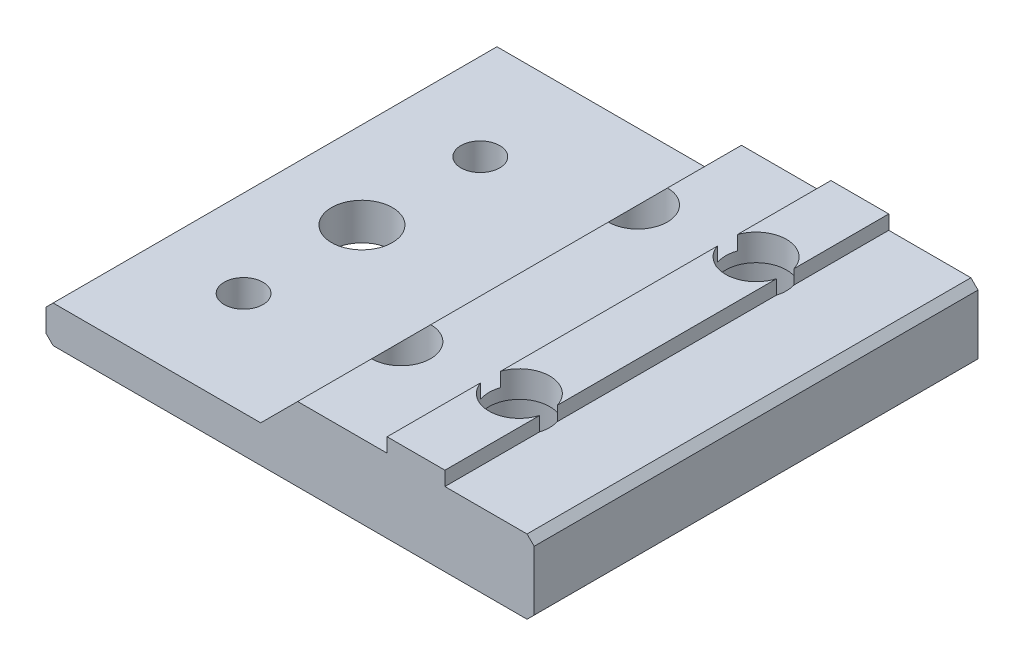
ISO-10303-21;
HEADER;
FILE_DESCRIPTION(('STEP AP214'),'2;1');
FILE_NAME('part.step','',(''),(''),'','','');
FILE_SCHEMA(('AUTOMOTIVE_DESIGN { 1 0 10303 214 1 1 1 1 }'));
ENDSEC;
DATA;
#1=APPLICATION_CONTEXT('core data for automotive mechanical design processes');
#2=APPLICATION_PROTOCOL_DEFINITION('international standard','automotive_design',2000,#1);
#3=PRODUCT_CONTEXT('',#1,'mechanical');
#4=PRODUCT('Part','Part','',(#3));
#5=PRODUCT_RELATED_PRODUCT_CATEGORY('part','',(#4));
#6=PRODUCT_DEFINITION_FORMATION('','',#4);
#7=PRODUCT_DEFINITION_CONTEXT('part definition',#1,'design');
#8=PRODUCT_DEFINITION('design','',#6,#7);
#9=PRODUCT_DEFINITION_SHAPE('','',#8);
#10=(LENGTH_UNIT() NAMED_UNIT(*) SI_UNIT(.MILLI.,.METRE.));
#11=(NAMED_UNIT(*) PLANE_ANGLE_UNIT() SI_UNIT($,.RADIAN.));
#12=(NAMED_UNIT(*) SI_UNIT($,.STERADIAN.) SOLID_ANGLE_UNIT());
#13=UNCERTAINTY_MEASURE_WITH_UNIT(LENGTH_MEASURE(1.E-05),#10,'distance_accuracy_value','');
#14=(GEOMETRIC_REPRESENTATION_CONTEXT(3) GLOBAL_UNCERTAINTY_ASSIGNED_CONTEXT((#13)) GLOBAL_UNIT_ASSIGNED_CONTEXT((#10,
#11,#12)) REPRESENTATION_CONTEXT('',''));
#15=CARTESIAN_POINT('',(0.,0.,0.));
#16=DIRECTION('',(0.,0.,1.));
#17=DIRECTION('',(1.,0.,0.));
#18=AXIS2_PLACEMENT_3D('',#15,#16,#17);
#19=CARTESIAN_POINT('',(58.6051391759039,56.6525658287971,11.1125));
#20=DIRECTION('',(0.,-1.,0.));
#21=DIRECTION('',(1.,0.,0.));
#22=AXIS2_PLACEMENT_3D('',#19,#20,#21);
#23=CYLINDRICAL_SURFACE('',#22,3.2639);
#24=CARTESIAN_POINT('',(58.6051391759039,16.9531190156371,11.1125));
#25=DIRECTION('',(0.,-1.,0.));
#26=DIRECTION('',(1.,0.,0.));
#27=AXIS2_PLACEMENT_3D('',#24,#25,#26);
#28=CIRCLE('',#27,3.2639);
#29=CARTESIAN_POINT('',(61.7293352787147,16.9531190156371,10.1678085576857));
#30=VERTEX_POINT('',#29);
#31=CARTESIAN_POINT('',(61.7293352787147,16.9531190156371,12.0571914423143));
#32=VERTEX_POINT('',#31);
#33=EDGE_CURVE('E246',#30,#32,#28,.T.);
#34=ORIENTED_EDGE('',*,*,#33,.F.);
#35=CARTESIAN_POINT('',(58.6051391759034,-3158.41431165819,11.1125));
#36=DIRECTION('',(-0.999999515985592,0.000983884435065971,0.));
#37=DIRECTION('',(-0.000983884435065971,-0.999999515985592,0.));
#38=AXIS2_PLACEMENT_3D('',#35,#36,#37);
#39=ELLIPSE('',#38,3317.36114900701,3.2639);
#40=CARTESIAN_POINT('',(61.7308339782703,18.4763658287973,10.1727791837681));
#41=VERTEX_POINT('',#40);
#42=EDGE_CURVE('E230',#41,#30,#39,.T.);
#43=ORIENTED_EDGE('',*,*,#42,.F.);
#44=CARTESIAN_POINT('',(58.6051391759039,18.4763658287973,11.1125));
#45=DIRECTION('',(0.,-1.,0.));
#46=DIRECTION('',(0.,0.,-1.));
#47=AXIS2_PLACEMENT_3D('',#44,#45,#46);
#48=CIRCLE('',#47,3.2639);
#49=CARTESIAN_POINT('',(55.5246918046987,18.4763658287973,10.0336639590584));
#50=VERTEX_POINT('',#49);
#51=EDGE_CURVE('E225',#50,#41,#48,.T.);
#52=ORIENTED_EDGE('',*,*,#51,.F.);
#53=DIRECTION('',(0.,-1.,0.));
#54=VECTOR('',#53,1.);
#55=CARTESIAN_POINT('',(55.5246918046987,56.6525658287971,10.0336639590584));
#56=LINE('',#55,#54);
#57=CARTESIAN_POINT('',(55.5246918046987,16.9523658287973,10.0336639590584));
#58=VERTEX_POINT('',#57);
#59=EDGE_CURVE('E42',#58,#50,#56,.F.);
#60=ORIENTED_EDGE('',*,*,#59,.F.);
#61=CARTESIAN_POINT('',(58.6051391759039,16.9523658287973,11.1125));
#62=DIRECTION('',(0.,-1.,0.));
#63=DIRECTION('',(0.,0.,-1.));
#64=AXIS2_PLACEMENT_3D('',#61,#62,#63);
#65=CIRCLE('',#64,3.2639);
#66=CARTESIAN_POINT('',(55.5246918046987,16.9523658287973,12.1913360409417));
#67=VERTEX_POINT('',#66);
#68=EDGE_CURVE('E250',#67,#58,#65,.T.);
#69=ORIENTED_EDGE('',*,*,#68,.F.);
#70=DIRECTION('',(0.,-1.,0.));
#71=VECTOR('',#70,1.);
#72=CARTESIAN_POINT('',(55.5246918046987,56.6525658287971,12.1913360409417));
#73=LINE('',#72,#71);
#74=CARTESIAN_POINT('',(55.5246918046987,18.4763658287973,12.1913360409417));
#75=VERTEX_POINT('',#74);
#76=EDGE_CURVE('E11',#75,#67,#73,.T.);
#77=ORIENTED_EDGE('',*,*,#76,.F.);
#78=CARTESIAN_POINT('',(61.7308339782703,18.4763658287973,12.0522208162319));
#79=VERTEX_POINT('',#78);
#80=EDGE_CURVE('E232',#79,#75,#48,.T.);
#81=ORIENTED_EDGE('',*,*,#80,.F.);
#82=EDGE_CURVE('E247',#32,#79,#39,.T.);
#83=ORIENTED_EDGE('',*,*,#82,.F.);
#84=EDGE_LOOP('',(#34,#43,#52,#60,#69,#77,#81,#83));
#85=FACE_BOUND('',#84,.T.);
#86=CARTESIAN_POINT('',(58.6051391759039,15.6315658287971,11.1125));
#87=DIRECTION('',(0.,-1.,0.));
#88=DIRECTION('',(1.,0.,0.));
#89=AXIS2_PLACEMENT_3D('',#86,#87,#88);
#90=CIRCLE('',#89,3.2639);
#91=CARTESIAN_POINT('',(61.8690391759039,15.6315658287971,11.1125));
#92=VERTEX_POINT('',#91);
#93=EDGE_CURVE('E37',#92,#92,#90,.F.);
#94=ORIENTED_EDGE('',*,*,#93,.F.);
#95=EDGE_LOOP('',(#94));
#96=FACE_BOUND('',#95,.T.);
#97=ADVANCED_FACE('F33',(#85,#96),#23,.F.);
#98=CARTESIAN_POINT('',(58.6051391759039,56.6525658287971,36.5125));
#99=DIRECTION('',(0.,-1.,0.));
#100=DIRECTION('',(1.,0.,0.));
#101=AXIS2_PLACEMENT_3D('',#98,#99,#100);
#102=CYLINDRICAL_SURFACE('',#101,3.2639);
#103=CARTESIAN_POINT('',(58.6051391759039,16.9531190156371,36.5125));
#104=DIRECTION('',(0.,-1.,0.));
#105=DIRECTION('',(1.,0.,0.));
#106=AXIS2_PLACEMENT_3D('',#103,#104,#105);
#107=CIRCLE('',#106,3.2639);
#108=CARTESIAN_POINT('',(61.7293352787147,16.9531190156371,35.5678085576857));
#109=VERTEX_POINT('',#108);
#110=CARTESIAN_POINT('',(61.7293352787147,16.9531190156371,37.4571914423143));
#111=VERTEX_POINT('',#110);
#112=EDGE_CURVE('E260',#109,#111,#107,.T.);
#113=ORIENTED_EDGE('',*,*,#112,.F.);
#114=CARTESIAN_POINT('',(58.6051391759034,-3158.41431165819,36.5125));
#115=DIRECTION('',(-0.999999515985592,0.000983884435065971,0.));
#116=DIRECTION('',(-0.000983884435065971,-0.999999515985592,0.));
#117=AXIS2_PLACEMENT_3D('',#114,#115,#116);
#118=ELLIPSE('',#117,3317.36114900701,3.2639);
#119=CARTESIAN_POINT('',(61.7308339782703,18.4763658287973,35.5727791837681));
#120=VERTEX_POINT('',#119);
#121=EDGE_CURVE('E256',#120,#109,#118,.T.);
#122=ORIENTED_EDGE('',*,*,#121,.F.);
#123=CARTESIAN_POINT('',(58.6051391759039,18.4763658287973,36.5125));
#124=DIRECTION('',(0.,-1.,0.));
#125=DIRECTION('',(0.,0.,-1.));
#126=AXIS2_PLACEMENT_3D('',#123,#124,#125);
#127=CIRCLE('',#126,3.2639);
#128=CARTESIAN_POINT('',(55.5246918046987,18.4763658287973,35.4336639590584));
#129=VERTEX_POINT('',#128);
#130=EDGE_CURVE('E253',#129,#120,#127,.T.);
#131=ORIENTED_EDGE('',*,*,#130,.F.);
#132=DIRECTION('',(0.,-1.,0.));
#133=VECTOR('',#132,1.);
#134=CARTESIAN_POINT('',(55.5246918046987,56.6525658287971,35.4336639590584));
#135=LINE('',#134,#133);
#136=CARTESIAN_POINT('',(55.5246918046987,16.9523658287973,35.4336639590584));
#137=VERTEX_POINT('',#136);
#138=EDGE_CURVE('E212',#137,#129,#135,.F.);
#139=ORIENTED_EDGE('',*,*,#138,.F.);
#140=CARTESIAN_POINT('',(58.6051391759039,16.9523658287973,36.5125));
#141=DIRECTION('',(0.,-1.,0.));
#142=DIRECTION('',(0.,0.,-1.));
#143=AXIS2_PLACEMENT_3D('',#140,#141,#142);
#144=CIRCLE('',#143,3.2639);
#145=CARTESIAN_POINT('',(55.5246918046987,16.9523658287973,37.5913360409417));
#146=VERTEX_POINT('',#145);
#147=EDGE_CURVE('E264',#146,#137,#144,.T.);
#148=ORIENTED_EDGE('',*,*,#147,.F.);
#149=DIRECTION('',(0.,-1.,0.));
#150=VECTOR('',#149,1.);
#151=CARTESIAN_POINT('',(55.5246918046987,56.6525658287971,37.5913360409417));
#152=LINE('',#151,#150);
#153=CARTESIAN_POINT('',(55.5246918046987,18.4763658287973,37.5913360409417));
#154=VERTEX_POINT('',#153);
#155=EDGE_CURVE('E219',#154,#146,#152,.T.);
#156=ORIENTED_EDGE('',*,*,#155,.F.);
#157=CARTESIAN_POINT('',(61.7308339782703,18.4763658287973,37.4522208162319));
#158=VERTEX_POINT('',#157);
#159=EDGE_CURVE('E257',#158,#154,#127,.T.);
#160=ORIENTED_EDGE('',*,*,#159,.F.);
#161=EDGE_CURVE('E261',#111,#158,#118,.T.);
#162=ORIENTED_EDGE('',*,*,#161,.F.);
#163=EDGE_LOOP('',(#113,#122,#131,#139,#148,#156,#160,#162));
#164=FACE_BOUND('',#163,.T.);
#165=CARTESIAN_POINT('',(58.6051391759039,15.6315658287971,36.5125));
#166=DIRECTION('',(0.,-1.,0.));
#167=DIRECTION('',(1.,0.,0.));
#168=AXIS2_PLACEMENT_3D('',#165,#166,#167);
#169=CIRCLE('',#168,3.2639);
#170=CARTESIAN_POINT('',(61.8690391759039,15.6315658287971,36.5125));
#171=VERTEX_POINT('',#170);
#172=EDGE_CURVE('E223',#171,#171,#169,.F.);
#173=ORIENTED_EDGE('',*,*,#172,.F.);
#174=EDGE_LOOP('',(#173));
#175=FACE_BOUND('',#174,.T.);
#176=ADVANCED_FACE('F412',(#164,#175),#102,.F.);
#177=CARTESIAN_POINT('',(61.7293352787147,16.9531190156371,47.625));
#178=DIRECTION('',(-0.999999515985592,0.000983884435065971,0.));
#179=DIRECTION('',(-0.000983884435065971,-0.999999515985592,0.));
#180=AXIS2_PLACEMENT_3D('',#177,#178,#179);
#181=PLANE('',#180);
#182=DIRECTION('',(0.,0.,-1.));
#183=VECTOR('',#182,1.);
#184=CARTESIAN_POINT('',(61.7293352787147,16.9531190156371,47.625));
#185=LINE('',#184,#183);
#186=EDGE_CURVE('E348',#109,#32,#185,.T.);
#187=ORIENTED_EDGE('',*,*,#186,.T.);
#188=ORIENTED_EDGE('',*,*,#82,.T.);
#189=DIRECTION('',(0.,0.,-1.));
#190=VECTOR('',#189,1.);
#191=CARTESIAN_POINT('',(61.7308339782703,18.4763658287973,47.625));
#192=LINE('',#191,#190);
#193=EDGE_CURVE('E343',#120,#79,#192,.T.);
#194=ORIENTED_EDGE('',*,*,#193,.F.);
#195=ORIENTED_EDGE('',*,*,#121,.T.);
#196=EDGE_LOOP('',(#187,#188,#194,#195));
#197=FACE_BOUND('',#196,.T.);
#198=ADVANCED_FACE('F418',(#197),#181,.F.);
#199=CARTESIAN_POINT('',(55.5246918046987,18.4763658287973,47.625));
#200=DIRECTION('',(0.,-1.,0.));
#201=DIRECTION('',(0.,0.,-1.));
#202=AXIS2_PLACEMENT_3D('',#199,#200,#201);
#203=PLANE('',#202);
#204=ORIENTED_EDGE('',*,*,#193,.T.);
#205=ORIENTED_EDGE('',*,*,#80,.T.);
#206=DIRECTION('',(0.,0.,-1.));
#207=VECTOR('',#206,1.);
#208=CARTESIAN_POINT('',(55.5246918046987,18.4763658287973,47.625));
#209=LINE('',#208,#207);
#210=EDGE_CURVE('E338',#129,#75,#209,.T.);
#211=ORIENTED_EDGE('',*,*,#210,.F.);
#212=ORIENTED_EDGE('',*,*,#130,.T.);
#213=EDGE_LOOP('',(#204,#205,#211,#212));
#214=FACE_BOUND('',#213,.T.);
#215=ADVANCED_FACE('F441',(#214),#203,.F.);
#216=CARTESIAN_POINT('',(55.5246918046987,16.9523658287973,47.625));
#217=DIRECTION('',(1.,0.,0.));
#218=DIRECTION('',(0.,0.,-1.));
#219=AXIS2_PLACEMENT_3D('',#216,#217,#218);
#220=PLANE('',#219);
#221=ORIENTED_EDGE('',*,*,#210,.T.);
#222=ORIENTED_EDGE('',*,*,#76,.T.);
#223=DIRECTION('',(0.,0.,-1.));
#224=VECTOR('',#223,1.);
#225=CARTESIAN_POINT('',(55.5246918046987,16.9523658287973,47.625));
#226=LINE('',#225,#224);
#227=EDGE_CURVE('E333',#137,#67,#226,.T.);
#228=ORIENTED_EDGE('',*,*,#227,.F.);
#229=ORIENTED_EDGE('',*,*,#138,.T.);
#230=EDGE_LOOP('',(#221,#222,#228,#229));
#231=FACE_BOUND('',#230,.T.);
#232=ADVANCED_FACE('F435',(#231),#220,.F.);
#233=CARTESIAN_POINT('',(61.7293352787147,16.9531190156371,47.625));
#234=VERTEX_POINT('',#233);
#235=EDGE_CURVE('E344',#234,#111,#185,.T.);
#236=ORIENTED_EDGE('',*,*,#235,.T.);
#237=ORIENTED_EDGE('',*,*,#161,.T.);
#238=CARTESIAN_POINT('',(61.7308339782703,18.4763658287973,47.625));
#239=VERTEX_POINT('',#238);
#240=EDGE_CURVE('E339',#239,#158,#192,.T.);
#241=ORIENTED_EDGE('',*,*,#240,.F.);
#242=DIRECTION('',(0.000983884435065971,0.999999515985592,0.));
#243=VECTOR('',#242,1.);
#244=CARTESIAN_POINT('',(61.7293352787147,16.9531190156371,47.625));
#245=LINE('',#244,#243);
#246=EDGE_CURVE('E291',#234,#239,#245,.T.);
#247=ORIENTED_EDGE('',*,*,#246,.F.);
#248=EDGE_LOOP('',(#236,#237,#241,#247));
#249=FACE_BOUND('',#248,.T.);
#250=ADVANCED_FACE('F447',(#249),#181,.F.);
#251=ORIENTED_EDGE('',*,*,#240,.T.);
#252=ORIENTED_EDGE('',*,*,#159,.T.);
#253=CARTESIAN_POINT('',(55.5246918046987,18.4763658287973,47.625));
#254=VERTEX_POINT('',#253);
#255=EDGE_CURVE('E334',#254,#154,#209,.T.);
#256=ORIENTED_EDGE('',*,*,#255,.F.);
#257=DIRECTION('',(-1.,0.,0.));
#258=VECTOR('',#257,1.);
#259=CARTESIAN_POINT('',(55.5246918046987,18.4763658287973,47.625));
#260=LINE('',#259,#258);
#261=EDGE_CURVE('E293',#239,#254,#260,.T.);
#262=ORIENTED_EDGE('',*,*,#261,.F.);
#263=EDGE_LOOP('',(#251,#252,#256,#262));
#264=FACE_BOUND('',#263,.T.);
#265=ADVANCED_FACE('F442',(#264),#203,.F.);
#266=ORIENTED_EDGE('',*,*,#255,.T.);
#267=ORIENTED_EDGE('',*,*,#155,.T.);
#268=CARTESIAN_POINT('',(55.5246918046987,16.9523658287973,47.625));
#269=VERTEX_POINT('',#268);
#270=EDGE_CURVE('E329',#269,#146,#226,.T.);
#271=ORIENTED_EDGE('',*,*,#270,.F.);
#272=DIRECTION('',(0.,-1.,0.));
#273=VECTOR('',#272,1.);
#274=CARTESIAN_POINT('',(55.5246918046987,16.9523658287973,47.625));
#275=LINE('',#274,#273);
#276=EDGE_CURVE('E295',#254,#269,#275,.T.);
#277=ORIENTED_EDGE('',*,*,#276,.F.);
#278=EDGE_LOOP('',(#266,#267,#271,#277));
#279=FACE_BOUND('',#278,.T.);
#280=ADVANCED_FACE('F436',(#279),#220,.F.);
#281=CARTESIAN_POINT('',(45.9234918046983,16.9523658287973,47.625));
#282=DIRECTION('',(0.,-1.,0.));
#283=DIRECTION('',(0.,0.,-1.));
#284=AXIS2_PLACEMENT_3D('',#281,#282,#283);
#285=PLANE('',#284);
#286=DIRECTION('',(0.,0.,-1.));
#287=VECTOR('',#286,1.);
#288=CARTESIAN_POINT('',(45.9234918046983,16.9523658287973,47.625));
#289=LINE('',#288,#287);
#290=CARTESIAN_POINT('',(45.9234918046983,16.9523658287973,7.93755304280271));
#291=VERTEX_POINT('',#290);
#292=CARTESIAN_POINT('',(45.9234918046983,16.9523658287973,0.));
#293=VERTEX_POINT('',#292);
#294=EDGE_CURVE('E204',#291,#293,#289,.T.);
#295=ORIENTED_EDGE('',*,*,#294,.F.);
#296=CARTESIAN_POINT('',(45.9051391759039,16.9523658287973,11.1125));
#297=DIRECTION('',(0.,-1.,0.));
#298=DIRECTION('',(0.,0.,-1.));
#299=AXIS2_PLACEMENT_3D('',#296,#297,#298);
#300=CIRCLE('',#299,3.175);
#301=CARTESIAN_POINT('',(45.9234918046983,16.9523658287973,14.2874469571973));
#302=VERTEX_POINT('',#301);
#303=EDGE_CURVE('E49',#291,#302,#300,.T.);
#304=ORIENTED_EDGE('',*,*,#303,.T.);
#305=CARTESIAN_POINT('',(45.9234918046983,16.9523658287973,33.3375530428027));
#306=VERTEX_POINT('',#305);
#307=EDGE_CURVE('E202',#306,#302,#289,.T.);
#308=ORIENTED_EDGE('',*,*,#307,.F.);
#309=CARTESIAN_POINT('',(45.9051391759039,16.9523658287973,36.5125));
#310=DIRECTION('',(0.,-1.,0.));
#311=DIRECTION('',(0.,0.,-1.));
#312=AXIS2_PLACEMENT_3D('',#309,#310,#311);
#313=CIRCLE('',#312,3.175);
#314=CARTESIAN_POINT('',(45.9234918046983,16.9523658287973,39.6874469571973));
#315=VERTEX_POINT('',#314);
#316=EDGE_CURVE('E56',#306,#315,#313,.T.);
#317=ORIENTED_EDGE('',*,*,#316,.T.);
#318=CARTESIAN_POINT('',(45.9234918046983,16.9523658287973,47.625));
#319=VERTEX_POINT('',#318);
#320=EDGE_CURVE('E210',#319,#315,#289,.T.);
#321=ORIENTED_EDGE('',*,*,#320,.F.);
#322=DIRECTION('',(-1.,0.,0.));
#323=VECTOR('',#322,1.);
#324=CARTESIAN_POINT('',(45.9234918046983,16.9523658287973,47.625));
#325=LINE('',#324,#323);
#326=EDGE_CURVE('E267',#269,#319,#325,.T.);
#327=ORIENTED_EDGE('',*,*,#326,.F.);
#328=ORIENTED_EDGE('',*,*,#270,.T.);
#329=ORIENTED_EDGE('',*,*,#147,.T.);
#330=ORIENTED_EDGE('',*,*,#227,.T.);
#331=ORIENTED_EDGE('',*,*,#68,.T.);
#332=CARTESIAN_POINT('',(55.5246918046987,16.9523658287973,0.));
#333=VERTEX_POINT('',#332);
#334=EDGE_CURVE('E297',#58,#333,#226,.T.);
#335=ORIENTED_EDGE('',*,*,#334,.T.);
#336=DIRECTION('',(-1.,0.,0.));
#337=VECTOR('',#336,1.);
#338=CARTESIAN_POINT('',(45.9234918046983,16.9523658287973,0.));
#339=LINE('',#338,#337);
#340=EDGE_CURVE('E298',#333,#293,#339,.T.);
#341=ORIENTED_EDGE('',*,*,#340,.T.);
#342=EDGE_LOOP('',(#295,#304,#308,#317,#321,#327,#328,#329,#330,#331,#335,#341));
#343=FACE_BOUND('',#342,.T.);
#344=ADVANCED_FACE('F35',(#343),#285,.F.);
#345=CARTESIAN_POINT('',(41.9610918046985,12.9899658287973,47.625));
#346=DIRECTION('',(0.707106781186564,-0.707106781186531,0.));
#347=DIRECTION('',(0.707106781186531,0.707106781186564,0.));
#348=AXIS2_PLACEMENT_3D('',#345,#346,#347);
#349=PLANE('',#348);
#350=ORIENTED_EDGE('',*,*,#307,.T.);
#351=CARTESIAN_POINT('',(45.9051391759039,16.9340132000029,11.1125));
#352=DIRECTION('',(0.707106781186564,-0.707106781186531,0.));
#353=DIRECTION('',(-0.707106781186531,-0.707106781186564,0.));
#354=AXIS2_PLACEMENT_3D('',#351,#352,#353);
#355=ELLIPSE('',#354,4.49012806053468,3.175);
#356=EDGE_CURVE('E193',#302,#291,#355,.T.);
#357=ORIENTED_EDGE('',*,*,#356,.T.);
#358=ORIENTED_EDGE('',*,*,#294,.T.);
#359=DIRECTION('',(-0.707106781186531,-0.707106781186564,0.));
#360=VECTOR('',#359,1.);
#361=CARTESIAN_POINT('',(41.9610918046985,12.9899658287973,0.));
#362=LINE('',#361,#360);
#363=CARTESIAN_POINT('',(41.9610918046985,12.9899658287973,0.));
#364=VERTEX_POINT('',#363);
#365=EDGE_CURVE('E300',#293,#364,#362,.T.);
#366=ORIENTED_EDGE('',*,*,#365,.T.);
#367=DIRECTION('',(0.,0.,-1.));
#368=VECTOR('',#367,1.);
#369=CARTESIAN_POINT('',(41.9610918046985,12.9899658287973,47.625));
#370=LINE('',#369,#368);
#371=CARTESIAN_POINT('',(41.9610918046985,12.9899658287973,47.625));
#372=VERTEX_POINT('',#371);
#373=EDGE_CURVE('E213',#372,#364,#370,.T.);
#374=ORIENTED_EDGE('',*,*,#373,.F.);
#375=DIRECTION('',(-0.707106781186531,-0.707106781186564,0.));
#376=VECTOR('',#375,1.);
#377=CARTESIAN_POINT('',(41.9610918046985,12.9899658287973,47.625));
#378=LINE('',#377,#376);
#379=EDGE_CURVE('E270',#319,#372,#378,.T.);
#380=ORIENTED_EDGE('',*,*,#379,.F.);
#381=ORIENTED_EDGE('',*,*,#320,.T.);
#382=CARTESIAN_POINT('',(45.9051391759039,16.9340132000029,36.5125));
#383=DIRECTION('',(0.707106781186564,-0.707106781186531,0.));
#384=DIRECTION('',(-0.707106781186531,-0.707106781186564,0.));
#385=AXIS2_PLACEMENT_3D('',#382,#383,#384);
#386=ELLIPSE('',#385,4.49012806053468,3.175);
#387=EDGE_CURVE('E209',#315,#306,#386,.T.);
#388=ORIENTED_EDGE('',*,*,#387,.T.);
#389=EDGE_LOOP('',(#350,#357,#358,#366,#374,#380,#381,#388));
#390=FACE_BOUND('',#389,.T.);
#391=ADVANCED_FACE('F207',(#390),#349,.F.);
#392=CARTESIAN_POINT('',(19.6852918046986,12.9899658287973,47.625));
#393=DIRECTION('',(0.,-1.,0.));
#394=DIRECTION('',(1.,0.,0.));
#395=AXIS2_PLACEMENT_3D('',#392,#393,#394);
#396=PLANE('',#395);
#397=CARTESIAN_POINT('',(29.0141391759039,12.9899658287973,23.8125));
#398=DIRECTION('',(0.,-1.,0.));
#399=DIRECTION('',(1.,0.,0.));
#400=AXIS2_PLACEMENT_3D('',#397,#398,#399);
#401=CIRCLE('',#400,3.2639);
#402=CARTESIAN_POINT('',(32.2780391759039,12.9899658287973,23.8125));
#403=VERTEX_POINT('',#402);
#404=EDGE_CURVE('E720',#403,#403,#401,.T.);
#405=ORIENTED_EDGE('',*,*,#404,.T.);
#406=EDGE_LOOP('',(#405));
#407=FACE_BOUND('',#406,.T.);
#408=CARTESIAN_POINT('',(29.0141391759039,12.9899658287973,11.1125));
#409=DIRECTION('',(0.,-1.,0.));
#410=DIRECTION('',(1.,0.,0.));
#411=AXIS2_PLACEMENT_3D('',#408,#409,#410);
#412=CIRCLE('',#411,2.0828);
#413=CARTESIAN_POINT('',(31.0969391759039,12.9899658287973,11.1125));
#414=VERTEX_POINT('',#413);
#415=EDGE_CURVE('E724',#414,#414,#412,.T.);
#416=ORIENTED_EDGE('',*,*,#415,.T.);
#417=EDGE_LOOP('',(#416));
#418=FACE_BOUND('',#417,.T.);
#419=CARTESIAN_POINT('',(29.0141391759039,12.9899658287973,36.5125));
#420=DIRECTION('',(0.,-1.,0.));
#421=DIRECTION('',(1.,0.,0.));
#422=AXIS2_PLACEMENT_3D('',#419,#420,#421);
#423=CIRCLE('',#422,2.0828);
#424=CARTESIAN_POINT('',(31.0969391759039,12.9899658287973,36.5125));
#425=VERTEX_POINT('',#424);
#426=EDGE_CURVE('E733',#425,#425,#423,.T.);
#427=ORIENTED_EDGE('',*,*,#426,.T.);
#428=EDGE_LOOP('',(#427));
#429=FACE_BOUND('',#428,.T.);
#430=DIRECTION('',(-1.,0.,0.));
#431=VECTOR('',#430,1.);
#432=CARTESIAN_POINT('',(19.6852918046986,12.9899658287973,0.));
#433=LINE('',#432,#431);
#434=CARTESIAN_POINT('',(19.6852918046986,12.9899658287973,0.));
#435=VERTEX_POINT('',#434);
#436=EDGE_CURVE('E302',#364,#435,#433,.T.);
#437=ORIENTED_EDGE('',*,*,#436,.T.);
#438=DIRECTION('',(0.,0.,-1.));
#439=VECTOR('',#438,1.);
#440=CARTESIAN_POINT('',(19.6852918046986,12.9899658287973,47.625));
#441=LINE('',#440,#439);
#442=CARTESIAN_POINT('',(19.6852918046986,12.9899658287973,47.625));
#443=VERTEX_POINT('',#442);
#444=EDGE_CURVE('E368',#443,#435,#441,.T.);
#445=ORIENTED_EDGE('',*,*,#444,.F.);
#446=DIRECTION('',(-1.,0.,0.));
#447=VECTOR('',#446,1.);
#448=CARTESIAN_POINT('',(19.6852918046986,12.9899658287973,47.625));
#449=LINE('',#448,#447);
#450=EDGE_CURVE('E273',#372,#443,#449,.T.);
#451=ORIENTED_EDGE('',*,*,#450,.F.);
#452=ORIENTED_EDGE('',*,*,#373,.T.);
#453=EDGE_LOOP('',(#437,#445,#451,#452));
#454=FACE_BOUND('',#453,.T.);
#455=ADVANCED_FACE('F379',(#407,#418,#429,#454),#396,.F.);
#456=CARTESIAN_POINT('',(19.6852918046986,12.9899658287973,47.625));
#457=DIRECTION('',(0.707106781186568,-0.707106781186527,0.));
#458=DIRECTION('',(0.707106781186527,0.707106781186568,0.));
#459=AXIS2_PLACEMENT_3D('',#456,#457,#458);
#460=PLANE('',#459);
#461=DIRECTION('',(-0.707106781186527,-0.707106781186568,0.));
#462=VECTOR('',#461,1.);
#463=CARTESIAN_POINT('',(19.6852918046986,12.9899658287973,0.));
#464=LINE('',#463,#462);
#465=CARTESIAN_POINT('',(18.9232918046986,12.2279658287973,0.));
#466=VERTEX_POINT('',#465);
#467=EDGE_CURVE('E304',#435,#466,#464,.T.);
#468=ORIENTED_EDGE('',*,*,#467,.T.);
#469=DIRECTION('',(0.,0.,-1.));
#470=VECTOR('',#469,1.);
#471=CARTESIAN_POINT('',(18.9232918046986,12.2279658287973,47.625));
#472=LINE('',#471,#470);
#473=CARTESIAN_POINT('',(18.9232918046986,12.2279658287973,47.625));
#474=VERTEX_POINT('',#473);
#475=EDGE_CURVE('E366',#474,#466,#472,.T.);
#476=ORIENTED_EDGE('',*,*,#475,.F.);
#477=DIRECTION('',(-0.707106781186527,-0.707106781186568,0.));
#478=VECTOR('',#477,1.);
#479=CARTESIAN_POINT('',(19.6852918046986,12.9899658287973,47.625));
#480=LINE('',#479,#478);
#481=EDGE_CURVE('E275',#443,#474,#480,.T.);
#482=ORIENTED_EDGE('',*,*,#481,.F.);
#483=ORIENTED_EDGE('',*,*,#444,.T.);
#484=EDGE_LOOP('',(#468,#476,#482,#483));
#485=FACE_BOUND('',#484,.T.);
#486=ADVANCED_FACE('F387',(#485),#460,.F.);
#487=CARTESIAN_POINT('',(18.9232918046986,9.78956582879718,47.625));
#488=DIRECTION('',(1.,0.,0.));
#489=DIRECTION('',(0.,0.,-1.));
#490=AXIS2_PLACEMENT_3D('',#487,#488,#489);
#491=PLANE('',#490);
#492=DIRECTION('',(0.,-1.,0.));
#493=VECTOR('',#492,1.);
#494=CARTESIAN_POINT('',(18.9232918046986,9.78956582879718,0.));
#495=LINE('',#494,#493);
#496=CARTESIAN_POINT('',(18.9232918046986,9.78956582879718,0.));
#497=VERTEX_POINT('',#496);
#498=EDGE_CURVE('E306',#466,#497,#495,.T.);
#499=ORIENTED_EDGE('',*,*,#498,.T.);
#500=DIRECTION('',(0.,0.,-1.));
#501=VECTOR('',#500,1.);
#502=CARTESIAN_POINT('',(18.9232918046986,9.78956582879718,47.625));
#503=LINE('',#502,#501);
#504=CARTESIAN_POINT('',(18.9232918046986,9.78956582879718,47.625));
#505=VERTEX_POINT('',#504);
#506=EDGE_CURVE('E363',#505,#497,#503,.T.);
#507=ORIENTED_EDGE('',*,*,#506,.F.);
#508=DIRECTION('',(0.,-1.,0.));
#509=VECTOR('',#508,1.);
#510=CARTESIAN_POINT('',(18.9232918046986,9.78956582879718,47.625));
#511=LINE('',#510,#509);
#512=EDGE_CURVE('E277',#474,#505,#511,.T.);
#513=ORIENTED_EDGE('',*,*,#512,.F.);
#514=ORIENTED_EDGE('',*,*,#475,.T.);
#515=EDGE_LOOP('',(#499,#507,#513,#514));
#516=FACE_BOUND('',#515,.T.);
#517=ADVANCED_FACE('F390',(#516),#491,.F.);
#518=CARTESIAN_POINT('',(18.9232918046986,9.78956582879718,47.625));
#519=DIRECTION('',(0.707106781186568,0.707106781186527,0.));
#520=DIRECTION('',(-0.707106781186527,0.707106781186568,0.));
#521=AXIS2_PLACEMENT_3D('',#518,#519,#520);
#522=PLANE('',#521);
#523=DIRECTION('',(0.707106781186527,-0.707106781186568,0.));
#524=VECTOR('',#523,1.);
#525=CARTESIAN_POINT('',(18.9232918046986,9.78956582879718,0.));
#526=LINE('',#525,#524);
#527=CARTESIAN_POINT('',(19.6852918046986,9.02756582879715,0.));
#528=VERTEX_POINT('',#527);
#529=EDGE_CURVE('E308',#497,#528,#526,.T.);
#530=ORIENTED_EDGE('',*,*,#529,.T.);
#531=DIRECTION('',(0.,0.,-1.));
#532=VECTOR('',#531,1.);
#533=CARTESIAN_POINT('',(19.6852918046986,9.02756582879715,47.625));
#534=LINE('',#533,#532);
#535=CARTESIAN_POINT('',(19.6852918046986,9.02756582879715,47.625));
#536=VERTEX_POINT('',#535);
#537=EDGE_CURVE('E360',#536,#528,#534,.T.);
#538=ORIENTED_EDGE('',*,*,#537,.F.);
#539=DIRECTION('',(0.707106781186527,-0.707106781186568,0.));
#540=VECTOR('',#539,1.);
#541=CARTESIAN_POINT('',(18.9232918046986,9.78956582879718,47.625));
#542=LINE('',#541,#540);
#543=EDGE_CURVE('E279',#505,#536,#542,.T.);
#544=ORIENTED_EDGE('',*,*,#543,.F.);
#545=ORIENTED_EDGE('',*,*,#506,.T.);
#546=EDGE_LOOP('',(#530,#538,#544,#545));
#547=FACE_BOUND('',#546,.T.);
#548=ADVANCED_FACE('F466',(#547),#522,.F.);
#549=CARTESIAN_POINT('',(19.6852918046986,9.02756582879715,47.625));
#550=DIRECTION('',(0.,1.,0.));
#551=DIRECTION('',(-1.,0.,0.));
#552=AXIS2_PLACEMENT_3D('',#549,#550,#551);
#553=PLANE('',#552);
#554=CARTESIAN_POINT('',(29.0141391759039,9.02756582879715,23.8125));
#555=DIRECTION('',(0.,-1.,0.));
#556=DIRECTION('',(1.,0.,0.));
#557=AXIS2_PLACEMENT_3D('',#554,#555,#556);
#558=CIRCLE('',#557,3.2639);
#559=CARTESIAN_POINT('',(32.2780391759039,9.02756582879715,23.8125));
#560=VERTEX_POINT('',#559);
#561=EDGE_CURVE('E717',#560,#560,#558,.T.);
#562=ORIENTED_EDGE('',*,*,#561,.F.);
#563=EDGE_LOOP('',(#562));
#564=FACE_BOUND('',#563,.T.);
#565=CARTESIAN_POINT('',(29.0141391759039,9.02756582879715,11.1125));
#566=DIRECTION('',(0.,-1.,0.));
#567=DIRECTION('',(1.,0.,0.));
#568=AXIS2_PLACEMENT_3D('',#565,#566,#567);
#569=CIRCLE('',#568,2.0828);
#570=CARTESIAN_POINT('',(31.0969391759039,9.02756582879715,11.1125));
#571=VERTEX_POINT('',#570);
#572=EDGE_CURVE('E721',#571,#571,#569,.T.);
#573=ORIENTED_EDGE('',*,*,#572,.F.);
#574=EDGE_LOOP('',(#573));
#575=FACE_BOUND('',#574,.T.);
#576=CARTESIAN_POINT('',(29.0141391759039,9.02756582879715,36.5125));
#577=DIRECTION('',(0.,-1.,0.));
#578=DIRECTION('',(1.,0.,0.));
#579=AXIS2_PLACEMENT_3D('',#576,#577,#578);
#580=CIRCLE('',#579,2.0828);
#581=CARTESIAN_POINT('',(31.0969391759039,9.02756582879715,36.5125));
#582=VERTEX_POINT('',#581);
#583=EDGE_CURVE('E730',#582,#582,#580,.T.);
#584=ORIENTED_EDGE('',*,*,#583,.F.);
#585=EDGE_LOOP('',(#584));
#586=FACE_BOUND('',#585,.T.);
#587=CARTESIAN_POINT('',(45.9051391759039,9.02756582879715,11.1125));
#588=DIRECTION('',(0.,-1.,0.));
#589=DIRECTION('',(1.,0.,0.));
#590=AXIS2_PLACEMENT_3D('',#587,#588,#589);
#591=CIRCLE('',#590,3.175);
#592=CARTESIAN_POINT('',(49.0801391759039,9.02756582879715,11.1125));
#593=VERTEX_POINT('',#592);
#594=EDGE_CURVE('E198',#593,#593,#591,.T.);
#595=ORIENTED_EDGE('',*,*,#594,.F.);
#596=EDGE_LOOP('',(#595));
#597=FACE_BOUND('',#596,.T.);
#598=CARTESIAN_POINT('',(45.9051391759039,9.02756582879715,36.5125));
#599=DIRECTION('',(0.,-1.,0.));
#600=DIRECTION('',(1.,0.,0.));
#601=AXIS2_PLACEMENT_3D('',#598,#599,#600);
#602=CIRCLE('',#601,3.175);
#603=CARTESIAN_POINT('',(49.0801391759039,9.02756582879715,36.5125));
#604=VERTEX_POINT('',#603);
#605=EDGE_CURVE('E205',#604,#604,#602,.T.);
#606=ORIENTED_EDGE('',*,*,#605,.F.);
#607=EDGE_LOOP('',(#606));
#608=FACE_BOUND('',#607,.T.);
#609=CARTESIAN_POINT('',(58.6051391759039,9.02756582879714,11.1125));
#610=DIRECTION('',(0.,-1.,0.));
#611=DIRECTION('',(1.,0.,0.));
#612=AXIS2_PLACEMENT_3D('',#609,#610,#611);
#613=CIRCLE('',#612,5.1562);
#614=CARTESIAN_POINT('',(63.7613391759039,9.02756582879714,11.1125));
#615=VERTEX_POINT('',#614);
#616=EDGE_CURVE('E241',#615,#615,#613,.T.);
#617=ORIENTED_EDGE('',*,*,#616,.F.);
#618=EDGE_LOOP('',(#617));
#619=FACE_BOUND('',#618,.T.);
#620=CARTESIAN_POINT('',(58.6051391759039,9.02756582879714,36.5125));
#621=DIRECTION('',(0.,-1.,0.));
#622=DIRECTION('',(1.,0.,0.));
#623=AXIS2_PLACEMENT_3D('',#620,#621,#622);
#624=CIRCLE('',#623,5.1562);
#625=CARTESIAN_POINT('',(63.7613391759039,9.02756582879714,36.5125));
#626=VERTEX_POINT('',#625);
#627=EDGE_CURVE('E234',#626,#626,#624,.T.);
#628=ORIENTED_EDGE('',*,*,#627,.F.);
#629=EDGE_LOOP('',(#628));
#630=FACE_BOUND('',#629,.T.);
#631=DIRECTION('',(1.,0.,0.));
#632=VECTOR('',#631,1.);
#633=CARTESIAN_POINT('',(19.6852918046986,9.02756582879715,0.));
#634=LINE('',#633,#632);
#635=CARTESIAN_POINT('',(70.5438888958435,9.02756582879714,0.));
#636=VERTEX_POINT('',#635);
#637=EDGE_CURVE('E310',#528,#636,#634,.T.);
#638=ORIENTED_EDGE('',*,*,#637,.T.);
#639=DIRECTION('',(0.,0.,-1.));
#640=VECTOR('',#639,1.);
#641=CARTESIAN_POINT('',(70.5438888958435,9.02756582879714,47.625));
#642=LINE('',#641,#640);
#643=CARTESIAN_POINT('',(70.5438888958435,9.02756582879714,47.625));
#644=VERTEX_POINT('',#643);
#645=EDGE_CURVE('E357',#644,#636,#642,.T.);
#646=ORIENTED_EDGE('',*,*,#645,.F.);
#647=DIRECTION('',(1.,0.,0.));
#648=VECTOR('',#647,1.);
#649=CARTESIAN_POINT('',(19.6852918046986,9.02756582879715,47.625));
#650=LINE('',#649,#648);
#651=EDGE_CURVE('E281',#536,#644,#650,.T.);
#652=ORIENTED_EDGE('',*,*,#651,.F.);
#653=ORIENTED_EDGE('',*,*,#537,.T.);
#654=EDGE_LOOP('',(#638,#646,#652,#653));
#655=FACE_BOUND('',#654,.T.);
#656=ADVANCED_FACE('F462',(#564,#575,#586,#597,#608,#619,#630,#655),#553,.F.);
#657=CARTESIAN_POINT('',(71.3051391759039,9.78956545997813,47.625));
#658=DIRECTION('',(-0.707454551344121,0.706758839904029,0.));
#659=DIRECTION('',(-0.706758839904029,-0.707454551344121,0.));
#660=AXIS2_PLACEMENT_3D('',#657,#658,#659);
#661=PLANE('',#660);
#662=DIRECTION('',(0.706758839904029,0.707454551344121,0.));
#663=VECTOR('',#662,1.);
#664=CARTESIAN_POINT('',(71.3051391759039,9.78956545997813,0.));
#665=LINE('',#664,#663);
#666=CARTESIAN_POINT('',(71.3051391759039,9.78956545997813,0.));
#667=VERTEX_POINT('',#666);
#668=EDGE_CURVE('E312',#636,#667,#665,.T.);
#669=ORIENTED_EDGE('',*,*,#668,.T.);
#670=DIRECTION('',(0.,0.,-1.));
#671=VECTOR('',#670,1.);
#672=CARTESIAN_POINT('',(71.3051391759039,9.78956545997813,47.625));
#673=LINE('',#672,#671);
#674=CARTESIAN_POINT('',(71.3051391759039,9.78956545997813,47.625));
#675=VERTEX_POINT('',#674);
#676=EDGE_CURVE('E354',#675,#667,#673,.T.);
#677=ORIENTED_EDGE('',*,*,#676,.F.);
#678=DIRECTION('',(0.706758839904029,0.707454551344121,0.));
#679=VECTOR('',#678,1.);
#680=CARTESIAN_POINT('',(71.3051391759039,9.78956545997813,47.625));
#681=LINE('',#680,#679);
#682=EDGE_CURVE('E283',#644,#675,#681,.T.);
#683=ORIENTED_EDGE('',*,*,#682,.F.);
#684=ORIENTED_EDGE('',*,*,#645,.T.);
#685=EDGE_LOOP('',(#669,#677,#683,#684));
#686=FACE_BOUND('',#685,.T.);
#687=ADVANCED_FACE('F458',(#686),#661,.F.);
#688=CARTESIAN_POINT('',(71.3051391759039,9.78956545997813,47.625));
#689=DIRECTION('',(-1.,0.,0.));
#690=DIRECTION('',(0.,-1.,0.));
#691=AXIS2_PLACEMENT_3D('',#688,#689,#690);
#692=PLANE('',#691);
#693=DIRECTION('',(0.,1.,0.));
#694=VECTOR('',#693,1.);
#695=CARTESIAN_POINT('',(71.3051391759039,9.78956545997813,0.));
#696=LINE('',#695,#694);
#697=CARTESIAN_POINT('',(71.3051391759039,16.1903692956976,0.));
#698=VERTEX_POINT('',#697);
#699=EDGE_CURVE('E314',#667,#698,#696,.T.);
#700=ORIENTED_EDGE('',*,*,#699,.T.);
#701=DIRECTION('',(0.,0.,-1.));
#702=VECTOR('',#701,1.);
#703=CARTESIAN_POINT('',(71.3051391759039,16.1903692956976,47.625));
#704=LINE('',#703,#702);
#705=CARTESIAN_POINT('',(71.3051391759039,16.1903692956976,47.625));
#706=VERTEX_POINT('',#705);
#707=EDGE_CURVE('E351',#706,#698,#704,.T.);
#708=ORIENTED_EDGE('',*,*,#707,.F.);
#709=DIRECTION('',(0.,1.,0.));
#710=VECTOR('',#709,1.);
#711=CARTESIAN_POINT('',(71.3051391759039,9.78956545997813,47.625));
#712=LINE('',#711,#710);
#713=EDGE_CURVE('E285',#675,#706,#712,.T.);
#714=ORIENTED_EDGE('',*,*,#713,.F.);
#715=ORIENTED_EDGE('',*,*,#676,.T.);
#716=EDGE_LOOP('',(#700,#708,#714,#715));
#717=FACE_BOUND('',#716,.T.);
#718=ADVANCED_FACE('F454',(#717),#692,.F.);
#719=CARTESIAN_POINT('',(70.5431395447228,16.9531190156372,47.625));
#720=DIRECTION('',(-0.707454551344087,-0.706758839904062,0.));
#721=DIRECTION('',(0.706758839904062,-0.707454551344087,0.));
#722=AXIS2_PLACEMENT_3D('',#719,#720,#721);
#723=PLANE('',#722);
#724=DIRECTION('',(-0.706758839904063,0.707454551344087,0.));
#725=VECTOR('',#724,1.);
#726=CARTESIAN_POINT('',(70.5431395447228,16.9531190156372,0.));
#727=LINE('',#726,#725);
#728=CARTESIAN_POINT('',(70.5431395447228,16.9531190156372,0.));
#729=VERTEX_POINT('',#728);
#730=EDGE_CURVE('E316',#698,#729,#727,.T.);
#731=ORIENTED_EDGE('',*,*,#730,.T.);
#732=DIRECTION('',(0.,0.,-1.));
#733=VECTOR('',#732,1.);
#734=CARTESIAN_POINT('',(70.5431395447228,16.9531190156372,47.625));
#735=LINE('',#734,#733);
#736=CARTESIAN_POINT('',(70.5431395447228,16.9531190156372,47.625));
#737=VERTEX_POINT('',#736);
#738=EDGE_CURVE('E347',#737,#729,#735,.T.);
#739=ORIENTED_EDGE('',*,*,#738,.F.);
#740=DIRECTION('',(-0.706758839904063,0.707454551344087,0.));
#741=VECTOR('',#740,1.);
#742=CARTESIAN_POINT('',(70.5431395447228,16.9531190156372,47.625));
#743=LINE('',#742,#741);
#744=EDGE_CURVE('E287',#706,#737,#743,.T.);
#745=ORIENTED_EDGE('',*,*,#744,.F.);
#746=ORIENTED_EDGE('',*,*,#707,.T.);
#747=EDGE_LOOP('',(#731,#739,#745,#746));
#748=FACE_BOUND('',#747,.T.);
#749=ADVANCED_FACE('F450',(#748),#723,.F.);
#750=CARTESIAN_POINT('',(61.7293352787147,16.9531190156371,47.625));
#751=DIRECTION('',(0.,-1.,0.));
#752=DIRECTION('',(1.,0.,0.));
#753=AXIS2_PLACEMENT_3D('',#750,#751,#752);
#754=PLANE('',#753);
#755=CARTESIAN_POINT('',(61.7293352787147,16.9531190156371,0.));
#756=VERTEX_POINT('',#755);
#757=EDGE_CURVE('E342',#30,#756,#185,.T.);
#758=ORIENTED_EDGE('',*,*,#757,.F.);
#759=ORIENTED_EDGE('',*,*,#33,.T.);
#760=ORIENTED_EDGE('',*,*,#186,.F.);
#761=ORIENTED_EDGE('',*,*,#112,.T.);
#762=ORIENTED_EDGE('',*,*,#235,.F.);
#763=DIRECTION('',(-1.,0.,0.));
#764=VECTOR('',#763,1.);
#765=CARTESIAN_POINT('',(61.7293352787147,16.9531190156371,47.625));
#766=LINE('',#765,#764);
#767=EDGE_CURVE('E289',#737,#234,#766,.T.);
#768=ORIENTED_EDGE('',*,*,#767,.F.);
#769=ORIENTED_EDGE('',*,*,#738,.T.);
#770=DIRECTION('',(-1.,0.,0.));
#771=VECTOR('',#770,1.);
#772=CARTESIAN_POINT('',(61.7293352787147,16.9531190156371,0.));
#773=LINE('',#772,#771);
#774=EDGE_CURVE('E318',#729,#756,#773,.T.);
#775=ORIENTED_EDGE('',*,*,#774,.T.);
#776=EDGE_LOOP('',(#758,#759,#760,#761,#762,#768,#769,#775));
#777=FACE_BOUND('',#776,.T.);
#778=ADVANCED_FACE('F445',(#777),#754,.F.);
#779=CARTESIAN_POINT('',(61.7308339782703,18.4763658287973,0.));
#780=VERTEX_POINT('',#779);
#781=EDGE_CURVE('E337',#41,#780,#192,.T.);
#782=ORIENTED_EDGE('',*,*,#781,.F.);
#783=ORIENTED_EDGE('',*,*,#42,.T.);
#784=ORIENTED_EDGE('',*,*,#757,.T.);
#785=DIRECTION('',(0.000983884435065971,0.999999515985592,0.));
#786=VECTOR('',#785,1.);
#787=CARTESIAN_POINT('',(61.7293352787147,16.9531190156371,0.));
#788=LINE('',#787,#786);
#789=EDGE_CURVE('E321',#756,#780,#788,.T.);
#790=ORIENTED_EDGE('',*,*,#789,.T.);
#791=EDGE_LOOP('',(#782,#783,#784,#790));
#792=FACE_BOUND('',#791,.T.);
#793=ADVANCED_FACE('F439',(#792),#181,.F.);
#794=CARTESIAN_POINT('',(55.5246918046987,18.4763658287973,0.));
#795=VERTEX_POINT('',#794);
#796=EDGE_CURVE('E332',#50,#795,#209,.T.);
#797=ORIENTED_EDGE('',*,*,#796,.F.);
#798=ORIENTED_EDGE('',*,*,#51,.T.);
#799=ORIENTED_EDGE('',*,*,#781,.T.);
#800=DIRECTION('',(-1.,0.,0.));
#801=VECTOR('',#800,1.);
#802=CARTESIAN_POINT('',(55.5246918046987,18.4763658287973,0.));
#803=LINE('',#802,#801);
#804=EDGE_CURVE('E324',#780,#795,#803,.T.);
#805=ORIENTED_EDGE('',*,*,#804,.T.);
#806=EDGE_LOOP('',(#797,#798,#799,#805));
#807=FACE_BOUND('',#806,.T.);
#808=ADVANCED_FACE('F433',(#807),#203,.F.);
#809=ORIENTED_EDGE('',*,*,#334,.F.);
#810=ORIENTED_EDGE('',*,*,#59,.T.);
#811=ORIENTED_EDGE('',*,*,#796,.T.);
#812=DIRECTION('',(0.,-1.,0.));
#813=VECTOR('',#812,1.);
#814=CARTESIAN_POINT('',(55.5246918046987,16.9523658287973,0.));
#815=LINE('',#814,#813);
#816=EDGE_CURVE('E271',#795,#333,#815,.T.);
#817=ORIENTED_EDGE('',*,*,#816,.T.);
#818=EDGE_LOOP('',(#809,#810,#811,#817));
#819=FACE_BOUND('',#818,.T.);
#820=ADVANCED_FACE('F427',(#819),#220,.F.);
#821=CARTESIAN_POINT('',(55.5246918046987,16.9523658287973,47.625));
#822=DIRECTION('',(0.,0.,1.));
#823=DIRECTION('',(1.,0.,0.));
#824=AXIS2_PLACEMENT_3D('',#821,#822,#823);
#825=PLANE('',#824);
#826=ORIENTED_EDGE('',*,*,#326,.T.);
#827=ORIENTED_EDGE('',*,*,#379,.T.);
#828=ORIENTED_EDGE('',*,*,#450,.T.);
#829=ORIENTED_EDGE('',*,*,#481,.T.);
#830=ORIENTED_EDGE('',*,*,#512,.T.);
#831=ORIENTED_EDGE('',*,*,#543,.T.);
#832=ORIENTED_EDGE('',*,*,#651,.T.);
#833=ORIENTED_EDGE('',*,*,#682,.T.);
#834=ORIENTED_EDGE('',*,*,#713,.T.);
#835=ORIENTED_EDGE('',*,*,#744,.T.);
#836=ORIENTED_EDGE('',*,*,#767,.T.);
#837=ORIENTED_EDGE('',*,*,#246,.T.);
#838=ORIENTED_EDGE('',*,*,#261,.T.);
#839=ORIENTED_EDGE('',*,*,#276,.T.);
#840=EDGE_LOOP('',(#826,#827,#828,#829,#830,#831,#832,#833,#834,#835,#836,#837,#838,#839));
#841=FACE_BOUND('',#840,.T.);
#842=ADVANCED_FACE('F394',(#841),#825,.T.);
#843=CARTESIAN_POINT('',(55.5246918046987,16.9523658287973,0.));
#844=DIRECTION('',(0.,0.,1.));
#845=DIRECTION('',(1.,0.,0.));
#846=AXIS2_PLACEMENT_3D('',#843,#844,#845);
#847=PLANE('',#846);
#848=ORIENTED_EDGE('',*,*,#340,.F.);
#849=ORIENTED_EDGE('',*,*,#816,.F.);
#850=ORIENTED_EDGE('',*,*,#804,.F.);
#851=ORIENTED_EDGE('',*,*,#789,.F.);
#852=ORIENTED_EDGE('',*,*,#774,.F.);
#853=ORIENTED_EDGE('',*,*,#730,.F.);
#854=ORIENTED_EDGE('',*,*,#699,.F.);
#855=ORIENTED_EDGE('',*,*,#668,.F.);
#856=ORIENTED_EDGE('',*,*,#637,.F.);
#857=ORIENTED_EDGE('',*,*,#529,.F.);
#858=ORIENTED_EDGE('',*,*,#498,.F.);
#859=ORIENTED_EDGE('',*,*,#467,.F.);
#860=ORIENTED_EDGE('',*,*,#436,.F.);
#861=ORIENTED_EDGE('',*,*,#365,.F.);
#862=EDGE_LOOP('',(#848,#849,#850,#851,#852,#853,#854,#855,#856,#857,#858,#859,#860,#861));
#863=FACE_BOUND('',#862,.T.);
#864=ADVANCED_FACE('F383',(#863),#847,.F.);
#865=CARTESIAN_POINT('',(58.6051391759039,15.6315658287971,36.5125));
#866=DIRECTION('',(0.,-1.,0.));
#867=DIRECTION('',(1.,0.,0.));
#868=AXIS2_PLACEMENT_3D('',#865,#866,#867);
#869=PLANE('',#868);
#870=CARTESIAN_POINT('',(58.6051391759039,15.6315658287971,36.5125));
#871=DIRECTION('',(0.,-1.,0.));
#872=DIRECTION('',(1.,0.,0.));
#873=AXIS2_PLACEMENT_3D('',#870,#871,#872);
#874=CIRCLE('',#873,5.1562);
#875=CARTESIAN_POINT('',(63.7613391759039,15.6315658287971,36.5125));
#876=VERTEX_POINT('',#875);
#877=EDGE_CURVE('E226',#876,#876,#874,.T.);
#878=ORIENTED_EDGE('',*,*,#877,.T.);
#879=EDGE_LOOP('',(#878));
#880=FACE_BOUND('',#879,.T.);
#881=ORIENTED_EDGE('',*,*,#172,.T.);
#882=EDGE_LOOP('',(#881));
#883=FACE_BOUND('',#882,.T.);
#884=ADVANCED_FACE('F430',(#880,#883),#869,.T.);
#885=CARTESIAN_POINT('',(58.6051391759039,15.6315658287971,36.5125));
#886=DIRECTION('',(0.,-1.,0.));
#887=DIRECTION('',(1.,0.,0.));
#888=AXIS2_PLACEMENT_3D('',#885,#886,#887);
#889=CYLINDRICAL_SURFACE('',#888,5.1562);
#890=ORIENTED_EDGE('',*,*,#877,.F.);
#891=EDGE_LOOP('',(#890));
#892=FACE_BOUND('',#891,.T.);
#893=ORIENTED_EDGE('',*,*,#627,.T.);
#894=EDGE_LOOP('',(#893));
#895=FACE_BOUND('',#894,.T.);
#896=ADVANCED_FACE('F422',(#892,#895),#889,.F.);
#897=CARTESIAN_POINT('',(58.6051391759039,15.6315658287971,11.1125));
#898=DIRECTION('',(0.,-1.,0.));
#899=DIRECTION('',(1.,0.,0.));
#900=AXIS2_PLACEMENT_3D('',#897,#898,#899);
#901=PLANE('',#900);
#902=CARTESIAN_POINT('',(58.6051391759039,15.6315658287971,11.1125));
#903=DIRECTION('',(0.,-1.,0.));
#904=DIRECTION('',(1.,0.,0.));
#905=AXIS2_PLACEMENT_3D('',#902,#903,#904);
#906=CIRCLE('',#905,5.1562);
#907=CARTESIAN_POINT('',(63.7613391759039,15.6315658287971,11.1125));
#908=VERTEX_POINT('',#907);
#909=EDGE_CURVE('E400',#908,#908,#906,.T.);
#910=ORIENTED_EDGE('',*,*,#909,.T.);
#911=EDGE_LOOP('',(#910));
#912=FACE_BOUND('',#911,.T.);
#913=ORIENTED_EDGE('',*,*,#93,.T.);
#914=EDGE_LOOP('',(#913));
#915=FACE_BOUND('',#914,.T.);
#916=ADVANCED_FACE('F409',(#912,#915),#901,.T.);
#917=CARTESIAN_POINT('',(58.6051391759039,15.6315658287971,11.1125));
#918=DIRECTION('',(0.,-1.,0.));
#919=DIRECTION('',(1.,0.,0.));
#920=AXIS2_PLACEMENT_3D('',#917,#918,#919);
#921=CYLINDRICAL_SURFACE('',#920,5.1562);
#922=ORIENTED_EDGE('',*,*,#909,.F.);
#923=EDGE_LOOP('',(#922));
#924=FACE_BOUND('',#923,.T.);
#925=ORIENTED_EDGE('',*,*,#616,.T.);
#926=EDGE_LOOP('',(#925));
#927=FACE_BOUND('',#926,.T.);
#928=ADVANCED_FACE('F629',(#924,#927),#921,.F.);
#929=CARTESIAN_POINT('',(45.9051391759039,18.4763658287973,36.5125));
#930=DIRECTION('',(0.,-1.,0.));
#931=DIRECTION('',(1.,0.,0.));
#932=AXIS2_PLACEMENT_3D('',#929,#930,#931);
#933=CYLINDRICAL_SURFACE('',#932,3.175);
#934=ORIENTED_EDGE('',*,*,#605,.T.);
#935=EDGE_LOOP('',(#934));
#936=FACE_BOUND('',#935,.T.);
#937=ORIENTED_EDGE('',*,*,#387,.F.);
#938=ORIENTED_EDGE('',*,*,#316,.F.);
#939=EDGE_LOOP('',(#937,#938));
#940=FACE_BOUND('',#939,.T.);
#941=ADVANCED_FACE('F637',(#936,#940),#933,.F.);
#942=CARTESIAN_POINT('',(45.9051391759039,18.4763658287973,11.1125));
#943=DIRECTION('',(0.,-1.,0.));
#944=DIRECTION('',(1.,0.,0.));
#945=AXIS2_PLACEMENT_3D('',#942,#943,#944);
#946=CYLINDRICAL_SURFACE('',#945,3.175);
#947=ORIENTED_EDGE('',*,*,#594,.T.);
#948=EDGE_LOOP('',(#947));
#949=FACE_BOUND('',#948,.T.);
#950=ORIENTED_EDGE('',*,*,#356,.F.);
#951=ORIENTED_EDGE('',*,*,#303,.F.);
#952=EDGE_LOOP('',(#950,#951));
#953=FACE_BOUND('',#952,.T.);
#954=ADVANCED_FACE('F194',(#949,#953),#946,.F.);
#955=CARTESIAN_POINT('',(29.0141391759039,18.4763658287973,36.5125));
#956=DIRECTION('',(0.,-1.,0.));
#957=DIRECTION('',(1.,0.,0.));
#958=AXIS2_PLACEMENT_3D('',#955,#956,#957);
#959=CYLINDRICAL_SURFACE('',#958,2.0828);
#960=ORIENTED_EDGE('',*,*,#583,.T.);
#961=EDGE_LOOP('',(#960));
#962=FACE_BOUND('',#961,.T.);
#963=ORIENTED_EDGE('',*,*,#426,.F.);
#964=EDGE_LOOP('',(#963));
#965=FACE_BOUND('',#964,.T.);
#966=ADVANCED_FACE('F666',(#962,#965),#959,.F.);
#967=CARTESIAN_POINT('',(29.0141391759039,18.4763658287973,11.1125));
#968=DIRECTION('',(0.,-1.,0.));
#969=DIRECTION('',(1.,0.,0.));
#970=AXIS2_PLACEMENT_3D('',#967,#968,#969);
#971=CYLINDRICAL_SURFACE('',#970,2.0828);
#972=ORIENTED_EDGE('',*,*,#572,.T.);
#973=EDGE_LOOP('',(#972));
#974=FACE_BOUND('',#973,.T.);
#975=ORIENTED_EDGE('',*,*,#415,.F.);
#976=EDGE_LOOP('',(#975));
#977=FACE_BOUND('',#976,.T.);
#978=ADVANCED_FACE('F690',(#974,#977),#971,.F.);
#979=CARTESIAN_POINT('',(29.0141391759039,18.4763658287973,23.8125));
#980=DIRECTION('',(0.,-1.,0.));
#981=DIRECTION('',(1.,0.,0.));
#982=AXIS2_PLACEMENT_3D('',#979,#980,#981);
#983=CYLINDRICAL_SURFACE('',#982,3.2639);
#984=ORIENTED_EDGE('',*,*,#561,.T.);
#985=EDGE_LOOP('',(#984));
#986=FACE_BOUND('',#985,.T.);
#987=ORIENTED_EDGE('',*,*,#404,.F.);
#988=EDGE_LOOP('',(#987));
#989=FACE_BOUND('',#988,.T.);
#990=ADVANCED_FACE('F700',(#986,#989),#983,.F.);
#991=CLOSED_SHELL('',(#97,#176,#198,#215,#232,#250,#265,#280,#344,#391,#455,#486,#517,#548,#656,
#687,#718,#749,#778,#793,#808,#820,#842,#864,#884,#896,#916,#928,#941,#954,#966,#978,#990));
#992=MANIFOLD_SOLID_BREP('B2',#991);
#993=ADVANCED_BREP_SHAPE_REPRESENTATION('',(#18,#992),#14);
#994=SHAPE_DEFINITION_REPRESENTATION(#9,#993);
ENDSEC;
END-ISO-10303-21;
